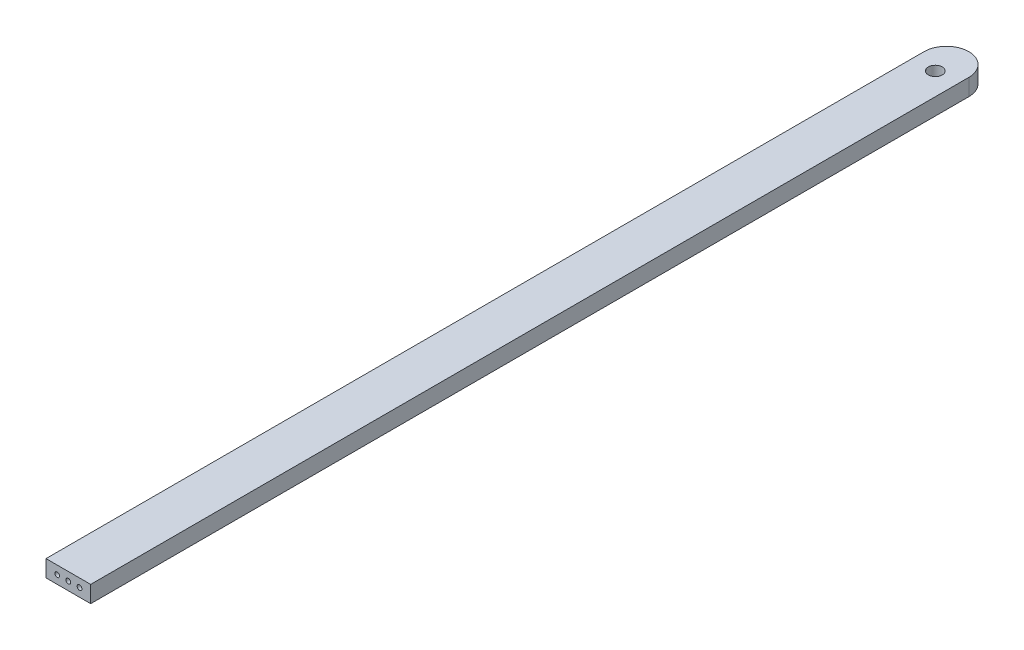
ISO-10303-21;
HEADER;
FILE_DESCRIPTION(('STEP AP214'),'2;1');
FILE_NAME('part.step','',(''),(''),'','','');
FILE_SCHEMA(('AUTOMOTIVE_DESIGN { 1 0 10303 214 1 1 1 1 }'));
ENDSEC;
DATA;
#1=APPLICATION_CONTEXT('core data for automotive mechanical design processes');
#2=APPLICATION_PROTOCOL_DEFINITION('international standard','automotive_design',2000,#1);
#3=PRODUCT_CONTEXT('',#1,'mechanical');
#4=PRODUCT('Part','Part','',(#3));
#5=PRODUCT_RELATED_PRODUCT_CATEGORY('part','',(#4));
#6=PRODUCT_DEFINITION_FORMATION('','',#4);
#7=PRODUCT_DEFINITION_CONTEXT('part definition',#1,'design');
#8=PRODUCT_DEFINITION('design','',#6,#7);
#9=PRODUCT_DEFINITION_SHAPE('','',#8);
#10=(LENGTH_UNIT() NAMED_UNIT(*) SI_UNIT(.MILLI.,.METRE.));
#11=(NAMED_UNIT(*) PLANE_ANGLE_UNIT() SI_UNIT($,.RADIAN.));
#12=(NAMED_UNIT(*) SI_UNIT($,.STERADIAN.) SOLID_ANGLE_UNIT());
#13=UNCERTAINTY_MEASURE_WITH_UNIT(LENGTH_MEASURE(1.E-05),#10,'distance_accuracy_value','');
#14=(GEOMETRIC_REPRESENTATION_CONTEXT(3) GLOBAL_UNCERTAINTY_ASSIGNED_CONTEXT((#13)) GLOBAL_UNIT_ASSIGNED_CONTEXT((#10,
#11,#12)) REPRESENTATION_CONTEXT('',''));
#15=CARTESIAN_POINT('',(0.,0.,0.));
#16=DIRECTION('',(0.,0.,1.));
#17=DIRECTION('',(1.,0.,0.));
#18=AXIS2_PLACEMENT_3D('',#15,#16,#17);
#19=CARTESIAN_POINT('',(0.,9.525,-6.35));
#20=DIRECTION('',(0.,-1.,0.));
#21=DIRECTION('',(0.,0.,-1.));
#22=AXIS2_PLACEMENT_3D('',#19,#20,#21);
#23=CYLINDRICAL_SURFACE('',#22,12.7);
#24=DIRECTION('',(0.,-1.,0.));
#25=VECTOR('',#24,1.);
#26=CARTESIAN_POINT('',(-12.7,9.525,-6.35));
#27=LINE('',#26,#25);
#28=CARTESIAN_POINT('',(-12.7,9.525,-6.35));
#29=VERTEX_POINT('',#28);
#30=CARTESIAN_POINT('',(-12.7,0.,-6.35));
#31=VERTEX_POINT('',#30);
#32=EDGE_CURVE('E185',#29,#31,#27,.T.);
#33=ORIENTED_EDGE('',*,*,#32,.F.);
#34=CARTESIAN_POINT('',(0.,9.525,-6.35));
#35=DIRECTION('',(0.,1.,0.));
#36=DIRECTION('',(0.,0.,1.));
#37=AXIS2_PLACEMENT_3D('',#34,#35,#36);
#38=CIRCLE('',#37,12.7);
#39=CARTESIAN_POINT('',(12.7,9.525,-6.35000000000007));
#40=VERTEX_POINT('',#39);
#41=EDGE_CURVE('E66',#40,#29,#38,.T.);
#42=ORIENTED_EDGE('',*,*,#41,.F.);
#43=DIRECTION('',(0.,-1.,0.));
#44=VECTOR('',#43,1.);
#45=CARTESIAN_POINT('',(12.7,9.525,-6.35));
#46=LINE('',#45,#44);
#47=CARTESIAN_POINT('',(12.7,0.,-6.35000000000007));
#48=VERTEX_POINT('',#47);
#49=EDGE_CURVE('E188',#48,#40,#46,.F.);
#50=ORIENTED_EDGE('',*,*,#49,.F.);
#51=CARTESIAN_POINT('',(0.,0.,-6.35));
#52=DIRECTION('',(0.,1.,0.));
#53=DIRECTION('',(0.,0.,1.));
#54=AXIS2_PLACEMENT_3D('',#51,#52,#53);
#55=CIRCLE('',#54,12.7);
#56=EDGE_CURVE('E11',#31,#48,#55,.F.);
#57=ORIENTED_EDGE('',*,*,#56,.F.);
#58=EDGE_LOOP('',(#33,#42,#50,#57));
#59=FACE_BOUND('',#58,.T.);
#60=ADVANCED_FACE('F57',(#59),#23,.T.);
#61=CARTESIAN_POINT('',(0.,9.525,0.));
#62=DIRECTION('',(0.,1.,0.));
#63=DIRECTION('',(0.,0.,1.));
#64=AXIS2_PLACEMENT_3D('',#61,#62,#63);
#65=PLANE('',#64);
#66=DIRECTION('',(0.,0.,-1.));
#67=VECTOR('',#66,1.);
#68=CARTESIAN_POINT('',(12.7,9.525,-19.05));
#69=LINE('',#68,#67);
#70=CARTESIAN_POINT('',(12.6999999999999,9.525,492.9124));
#71=VERTEX_POINT('',#70);
#72=EDGE_CURVE('E165',#71,#40,#69,.T.);
#73=ORIENTED_EDGE('',*,*,#72,.T.);
#74=ORIENTED_EDGE('',*,*,#41,.T.);
#75=DIRECTION('',(0.,0.,1.));
#76=VECTOR('',#75,1.);
#77=CARTESIAN_POINT('',(-12.7,9.525,-19.05));
#78=LINE('',#77,#76);
#79=CARTESIAN_POINT('',(-12.6999999999999,9.525,492.9124));
#80=VERTEX_POINT('',#79);
#81=EDGE_CURVE('E158',#29,#80,#78,.T.);
#82=ORIENTED_EDGE('',*,*,#81,.T.);
#83=DIRECTION('',(1.,0.,0.));
#84=VECTOR('',#83,1.);
#85=CARTESIAN_POINT('',(-12.6999999999999,9.525,492.9124));
#86=LINE('',#85,#84);
#87=EDGE_CURVE('E161',#80,#71,#86,.T.);
#88=ORIENTED_EDGE('',*,*,#87,.T.);
#89=EDGE_LOOP('',(#73,#74,#82,#88));
#90=FACE_BOUND('',#89,.T.);
#91=CARTESIAN_POINT('',(0.,9.525,0.));
#92=DIRECTION('',(0.,1.,0.));
#93=DIRECTION('',(0.,0.,1.));
#94=AXIS2_PLACEMENT_3D('',#91,#92,#93);
#95=CIRCLE('',#94,3.96875);
#96=CARTESIAN_POINT('',(0.,9.525,-3.96875));
#97=VERTEX_POINT('',#96);
#98=EDGE_CURVE('E150',#97,#97,#95,.T.);
#99=ORIENTED_EDGE('',*,*,#98,.F.);
#100=EDGE_LOOP('',(#99));
#101=FACE_BOUND('',#100,.T.);
#102=ADVANCED_FACE('F192',(#90,#101),#65,.T.);
#103=CARTESIAN_POINT('',(0.,0.,0.));
#104=DIRECTION('',(0.,1.,0.));
#105=DIRECTION('',(0.,0.,1.));
#106=AXIS2_PLACEMENT_3D('',#103,#104,#105);
#107=PLANE('',#106);
#108=DIRECTION('',(0.,0.,1.));
#109=VECTOR('',#108,1.);
#110=CARTESIAN_POINT('',(-12.7,0.,-19.05));
#111=LINE('',#110,#109);
#112=CARTESIAN_POINT('',(-12.6999999999999,0.,492.9124));
#113=VERTEX_POINT('',#112);
#114=EDGE_CURVE('E154',#31,#113,#111,.T.);
#115=ORIENTED_EDGE('',*,*,#114,.F.);
#116=ORIENTED_EDGE('',*,*,#56,.T.);
#117=DIRECTION('',(0.,0.,-1.));
#118=VECTOR('',#117,1.);
#119=CARTESIAN_POINT('',(12.7,0.,-19.05));
#120=LINE('',#119,#118);
#121=CARTESIAN_POINT('',(12.6999999999999,0.,492.9124));
#122=VERTEX_POINT('',#121);
#123=EDGE_CURVE('E162',#122,#48,#120,.T.);
#124=ORIENTED_EDGE('',*,*,#123,.F.);
#125=DIRECTION('',(1.,0.,0.));
#126=VECTOR('',#125,1.);
#127=CARTESIAN_POINT('',(-12.6999999999999,0.,492.9124));
#128=LINE('',#127,#126);
#129=EDGE_CURVE('E172',#113,#122,#128,.T.);
#130=ORIENTED_EDGE('',*,*,#129,.F.);
#131=EDGE_LOOP('',(#115,#116,#124,#130));
#132=FACE_BOUND('',#131,.T.);
#133=CARTESIAN_POINT('',(0.,0.,0.));
#134=DIRECTION('',(0.,1.,0.));
#135=DIRECTION('',(0.,0.,1.));
#136=AXIS2_PLACEMENT_3D('',#133,#134,#135);
#137=CIRCLE('',#136,3.96875);
#138=CARTESIAN_POINT('',(0.,0.,-3.96875));
#139=VERTEX_POINT('',#138);
#140=EDGE_CURVE('E149',#139,#139,#137,.T.);
#141=ORIENTED_EDGE('',*,*,#140,.T.);
#142=EDGE_LOOP('',(#141));
#143=FACE_BOUND('',#142,.T.);
#144=ADVANCED_FACE('F206',(#132,#143),#107,.F.);
#145=CARTESIAN_POINT('',(-12.7,9.525,-19.05));
#146=DIRECTION('',(1.,0.,0.));
#147=DIRECTION('',(0.,0.,-1.));
#148=AXIS2_PLACEMENT_3D('',#145,#146,#147);
#149=PLANE('',#148);
#150=ORIENTED_EDGE('',*,*,#81,.F.);
#151=ORIENTED_EDGE('',*,*,#32,.T.);
#152=ORIENTED_EDGE('',*,*,#114,.T.);
#153=DIRECTION('',(0.,-1.,0.));
#154=VECTOR('',#153,1.);
#155=CARTESIAN_POINT('',(-12.6999999999999,9.525,492.9124));
#156=LINE('',#155,#154);
#157=EDGE_CURVE('E181',#80,#113,#156,.T.);
#158=ORIENTED_EDGE('',*,*,#157,.F.);
#159=EDGE_LOOP('',(#150,#151,#152,#158));
#160=FACE_BOUND('',#159,.T.);
#161=ADVANCED_FACE('F199',(#160),#149,.F.);
#162=CARTESIAN_POINT('',(-12.6999999999999,9.525,492.9124));
#163=DIRECTION('',(0.,0.,-1.));
#164=DIRECTION('',(-1.,0.,0.));
#165=AXIS2_PLACEMENT_3D('',#162,#163,#164);
#166=PLANE('',#165);
#167=CARTESIAN_POINT('',(-6.34999999999997,4.7625,492.9124));
#168=DIRECTION('',(0.,0.,1.));
#169=DIRECTION('',(1.,0.,0.));
#170=AXIS2_PLACEMENT_3D('',#167,#168,#169);
#171=CIRCLE('',#170,1.35254999999999);
#172=CARTESIAN_POINT('',(-4.99744999999998,4.7625,492.9124));
#173=VERTEX_POINT('',#172);
#174=EDGE_CURVE('E127',#173,#173,#171,.T.);
#175=ORIENTED_EDGE('',*,*,#174,.F.);
#176=EDGE_LOOP('',(#175));
#177=FACE_BOUND('',#176,.T.);
#178=CARTESIAN_POINT('',(0.,4.7625,492.9124));
#179=DIRECTION('',(0.,0.,1.));
#180=DIRECTION('',(1.,0.,0.));
#181=AXIS2_PLACEMENT_3D('',#178,#179,#180);
#182=CIRCLE('',#181,1.35254999999999);
#183=CARTESIAN_POINT('',(1.35254999999999,4.7625,492.9124));
#184=VERTEX_POINT('',#183);
#185=EDGE_CURVE('E126',#184,#184,#182,.T.);
#186=ORIENTED_EDGE('',*,*,#185,.F.);
#187=EDGE_LOOP('',(#186));
#188=FACE_BOUND('',#187,.T.);
#189=CARTESIAN_POINT('',(6.34999999999997,4.7625,492.9124));
#190=DIRECTION('',(0.,0.,1.));
#191=DIRECTION('',(1.,0.,0.));
#192=AXIS2_PLACEMENT_3D('',#189,#190,#191);
#193=CIRCLE('',#192,1.35254999999999);
#194=CARTESIAN_POINT('',(7.70254999999996,4.7625,492.9124));
#195=VERTEX_POINT('',#194);
#196=EDGE_CURVE('E141',#195,#195,#193,.T.);
#197=ORIENTED_EDGE('',*,*,#196,.F.);
#198=EDGE_LOOP('',(#197));
#199=FACE_BOUND('',#198,.T.);
#200=ORIENTED_EDGE('',*,*,#129,.T.);
#201=DIRECTION('',(0.,-1.,0.));
#202=VECTOR('',#201,1.);
#203=CARTESIAN_POINT('',(12.6999999999999,9.525,492.9124));
#204=LINE('',#203,#202);
#205=EDGE_CURVE('E169',#71,#122,#204,.T.);
#206=ORIENTED_EDGE('',*,*,#205,.F.);
#207=ORIENTED_EDGE('',*,*,#87,.F.);
#208=ORIENTED_EDGE('',*,*,#157,.T.);
#209=EDGE_LOOP('',(#200,#206,#207,#208));
#210=FACE_BOUND('',#209,.T.);
#211=ADVANCED_FACE('F202',(#177,#188,#199,#210),#166,.F.);
#212=CARTESIAN_POINT('',(12.7,9.525,-19.05));
#213=DIRECTION('',(-1.,0.,0.));
#214=DIRECTION('',(0.,0.,1.));
#215=AXIS2_PLACEMENT_3D('',#212,#213,#214);
#216=PLANE('',#215);
#217=ORIENTED_EDGE('',*,*,#123,.T.);
#218=ORIENTED_EDGE('',*,*,#49,.T.);
#219=ORIENTED_EDGE('',*,*,#72,.F.);
#220=ORIENTED_EDGE('',*,*,#205,.T.);
#221=EDGE_LOOP('',(#217,#218,#219,#220));
#222=FACE_BOUND('',#221,.T.);
#223=ADVANCED_FACE('F205',(#222),#216,.F.);
#224=CARTESIAN_POINT('',(0.,9.525,0.));
#225=DIRECTION('',(0.,-1.,0.));
#226=DIRECTION('',(0.,0.,-1.));
#227=AXIS2_PLACEMENT_3D('',#224,#225,#226);
#228=CYLINDRICAL_SURFACE('',#227,3.96875);
#229=CARTESIAN_POINT('',(0.,9.525,-3.96875));
#230=CARTESIAN_POINT('',(0.,9.42578125,-3.96875));
#231=CARTESIAN_POINT('',(0.,9.3265625,-3.96875));
#232=CARTESIAN_POINT('',(0.,9.128125,-3.96875));
#233=CARTESIAN_POINT('',(0.,9.02890625,-3.96875));
#234=CARTESIAN_POINT('',(0.,8.83046875,-3.96875));
#235=CARTESIAN_POINT('',(0.,8.73125,-3.96875));
#236=CARTESIAN_POINT('',(0.,8.5328125,-3.96875));
#237=CARTESIAN_POINT('',(0.,8.43359375,-3.96875));
#238=CARTESIAN_POINT('',(0.,8.23515625,-3.96875));
#239=CARTESIAN_POINT('',(0.,8.1359375,-3.96875));
#240=CARTESIAN_POINT('',(0.,7.9375,-3.96875));
#241=CARTESIAN_POINT('',(0.,7.83828125,-3.96875));
#242=CARTESIAN_POINT('',(0.,7.63984375,-3.96875));
#243=CARTESIAN_POINT('',(0.,7.540625,-3.96875));
#244=CARTESIAN_POINT('',(0.,7.3421875,-3.96875));
#245=CARTESIAN_POINT('',(0.,7.24296875,-3.96875));
#246=CARTESIAN_POINT('',(0.,7.04453125,-3.96875));
#247=CARTESIAN_POINT('',(0.,6.9453125,-3.96875));
#248=CARTESIAN_POINT('',(0.,6.746875,-3.96875));
#249=CARTESIAN_POINT('',(0.,6.64765625,-3.96875));
#250=CARTESIAN_POINT('',(0.,6.44921875,-3.96875));
#251=CARTESIAN_POINT('',(0.,6.35,-3.96875));
#252=CARTESIAN_POINT('',(0.,6.1515625,-3.96875));
#253=CARTESIAN_POINT('',(0.,6.05234375,-3.96875));
#254=CARTESIAN_POINT('',(0.,5.85390625,-3.96875));
#255=CARTESIAN_POINT('',(0.,5.7546875,-3.96875));
#256=CARTESIAN_POINT('',(0.,5.55625,-3.96875));
#257=CARTESIAN_POINT('',(0.,5.45703125,-3.96875));
#258=CARTESIAN_POINT('',(0.,5.25859375,-3.96875));
#259=CARTESIAN_POINT('',(0.,5.159375,-3.96875));
#260=CARTESIAN_POINT('',(0.,4.9609375,-3.96875));
#261=CARTESIAN_POINT('',(0.,4.86171875,-3.96875));
#262=CARTESIAN_POINT('',(0.,4.66328125,-3.96875));
#263=CARTESIAN_POINT('',(0.,4.5640625,-3.96875));
#264=CARTESIAN_POINT('',(0.,4.365625,-3.96875));
#265=CARTESIAN_POINT('',(0.,4.26640625,-3.96875));
#266=CARTESIAN_POINT('',(0.,4.06796875,-3.96875));
#267=CARTESIAN_POINT('',(0.,3.96875,-3.96875));
#268=CARTESIAN_POINT('',(0.,3.7703125,-3.96875));
#269=CARTESIAN_POINT('',(0.,3.67109375,-3.96875));
#270=CARTESIAN_POINT('',(0.,3.47265625,-3.96875));
#271=CARTESIAN_POINT('',(0.,3.3734375,-3.96875));
#272=CARTESIAN_POINT('',(0.,3.175,-3.96875));
#273=CARTESIAN_POINT('',(0.,3.07578125,-3.96875));
#274=CARTESIAN_POINT('',(0.,2.87734375,-3.96875));
#275=CARTESIAN_POINT('',(0.,2.778125,-3.96875));
#276=CARTESIAN_POINT('',(0.,2.5796875,-3.96875));
#277=CARTESIAN_POINT('',(0.,2.48046875,-3.96875));
#278=CARTESIAN_POINT('',(0.,2.28203125,-3.96875));
#279=CARTESIAN_POINT('',(0.,2.1828125,-3.96875));
#280=CARTESIAN_POINT('',(0.,1.984375,-3.96875));
#281=CARTESIAN_POINT('',(0.,1.88515625,-3.96875));
#282=CARTESIAN_POINT('',(0.,1.68671875,-3.96875));
#283=CARTESIAN_POINT('',(0.,1.5875,-3.96875));
#284=CARTESIAN_POINT('',(0.,1.3890625,-3.96875));
#285=CARTESIAN_POINT('',(0.,1.28984375,-3.96875));
#286=CARTESIAN_POINT('',(0.,1.09140625,-3.96875));
#287=CARTESIAN_POINT('',(0.,0.992187500000001,-3.96875));
#288=CARTESIAN_POINT('',(0.,0.793750000000001,-3.96875));
#289=CARTESIAN_POINT('',(0.,0.69453125,-3.96875));
#290=CARTESIAN_POINT('',(0.,0.49609375,-3.96875));
#291=CARTESIAN_POINT('',(0.,0.396875,-3.96875));
#292=CARTESIAN_POINT('',(0.,0.1984375,-3.96875));
#293=CARTESIAN_POINT('',(0.,0.0992187500000001,-3.96875));
#294=CARTESIAN_POINT('',(0.,0.,-3.96875));
#295=B_SPLINE_CURVE_WITH_KNOTS('',3,(#229,#230,#231,#232,#233,#234,#235,#236,#237,#238,#239,
#240,#241,#242,#243,#244,#245,#246,#247,#248,#249,#250,#251,#252,#253,#254,#255,#256,#257,#258,
#259,#260,#261,#262,#263,#264,#265,#266,#267,#268,#269,#270,#271,#272,#273,#274,#275,#276,#277,
#278,#279,#280,#281,#282,#283,#284,#285,#286,#287,#288,#289,#290,#291,#292,#293,#294),
.UNSPECIFIED.,.F.,.F.,(4,2,2,2,2,2,2,2,2,2,2,2,2,2,2,2,2,2,2,2,2,2,2,2,2,2,2,2,2,2,2,2,4),(0.,
0.297656249999998,0.595312499999999,0.892968749999999,1.190625,1.48828125,1.7859375,2.08359375,
2.38125,2.67890625,2.9765625,3.27421875,3.571875,3.86953125,4.1671875,4.46484375,4.7625,
5.06015625,5.3578125,5.65546875,5.953125,6.25078125,6.5484375,6.84609375,7.14375,7.44140625,
7.7390625,8.03671875,8.334375,8.63203125,8.9296875,9.22734375,9.525),.UNSPECIFIED.);
#296=EDGE_CURVE('BSEAM212',#97,#139,#295,.T.);
#297=ORIENTED_EDGE('',*,*,#98,.T.);
#298=ORIENTED_EDGE('',*,*,#140,.F.);
#299=ORIENTED_EDGE('',*,*,#296,.T.);
#300=ORIENTED_EDGE('',*,*,#296,.F.);
#301=EDGE_LOOP('',(#297,#299,#298,#300));
#302=FACE_BOUND('',#301,.T.);
#303=ADVANCED_FACE('F212',(#302),#228,.F.);
#304=CARTESIAN_POINT('',(6.34999999999997,4.7625,479.425));
#305=DIRECTION('',(0.,0.,1.));
#306=DIRECTION('',(1.,0.,0.));
#307=AXIS2_PLACEMENT_3D('',#304,#305,#306);
#308=CONICAL_SURFACE('',#307,1.35254999999999,1.02974425867664);
#309=CARTESIAN_POINT('',(6.34999999999997,4.7625,478.612305969734));
#310=VERTEX_POINT('',#309);
#311=VERTEX_LOOP('',#310);
#312=FACE_BOUND('',#311,.T.);
#313=CARTESIAN_POINT('',(6.34999999999997,4.7625,479.425));
#314=DIRECTION('',(0.,0.,1.));
#315=DIRECTION('',(1.,0.,0.));
#316=AXIS2_PLACEMENT_3D('',#313,#314,#315);
#317=CIRCLE('',#316,1.35254999999999);
#318=CARTESIAN_POINT('',(7.70254999999996,4.7625,479.425));
#319=VERTEX_POINT('',#318);
#320=EDGE_CURVE('E145',#319,#319,#317,.T.);
#321=ORIENTED_EDGE('',*,*,#320,.T.);
#322=EDGE_LOOP('',(#321));
#323=FACE_BOUND('',#322,.T.);
#324=ADVANCED_FACE('F214',(#312,#323),#308,.F.);
#325=CARTESIAN_POINT('',(6.34999999999997,4.7625,492.9124));
#326=DIRECTION('',(0.,0.,1.));
#327=DIRECTION('',(1.,0.,0.));
#328=AXIS2_PLACEMENT_3D('',#325,#326,#327);
#329=CYLINDRICAL_SURFACE('',#328,1.35254999999999);
#330=ORIENTED_EDGE('',*,*,#320,.F.);
#331=EDGE_LOOP('',(#330));
#332=FACE_BOUND('',#331,.T.);
#333=ORIENTED_EDGE('',*,*,#196,.T.);
#334=EDGE_LOOP('',(#333));
#335=FACE_BOUND('',#334,.T.);
#336=ADVANCED_FACE('F220',(#332,#335),#329,.F.);
#337=CARTESIAN_POINT('',(0.,4.7625,479.425));
#338=DIRECTION('',(0.,0.,1.));
#339=DIRECTION('',(1.,0.,0.));
#340=AXIS2_PLACEMENT_3D('',#337,#338,#339);
#341=CONICAL_SURFACE('',#340,1.35254999999999,1.02974425867664);
#342=CARTESIAN_POINT('',(0.,4.7625,478.612305969734));
#343=VERTEX_POINT('',#342);
#344=VERTEX_LOOP('',#343);
#345=FACE_BOUND('',#344,.T.);
#346=CARTESIAN_POINT('',(0.,4.7625,479.425));
#347=DIRECTION('',(0.,0.,1.));
#348=DIRECTION('',(1.,0.,0.));
#349=AXIS2_PLACEMENT_3D('',#346,#347,#348);
#350=CIRCLE('',#349,1.35254999999999);
#351=CARTESIAN_POINT('',(1.35254999999999,4.7625,479.425));
#352=VERTEX_POINT('',#351);
#353=EDGE_CURVE('E133',#352,#352,#350,.T.);
#354=ORIENTED_EDGE('',*,*,#353,.T.);
#355=EDGE_LOOP('',(#354));
#356=FACE_BOUND('',#355,.T.);
#357=ADVANCED_FACE('F256',(#345,#356),#341,.F.);
#358=CARTESIAN_POINT('',(0.,4.7625,492.9124));
#359=DIRECTION('',(0.,0.,1.));
#360=DIRECTION('',(1.,0.,0.));
#361=AXIS2_PLACEMENT_3D('',#358,#359,#360);
#362=CYLINDRICAL_SURFACE('',#361,1.35254999999999);
#363=ORIENTED_EDGE('',*,*,#353,.F.);
#364=EDGE_LOOP('',(#363));
#365=FACE_BOUND('',#364,.T.);
#366=ORIENTED_EDGE('',*,*,#185,.T.);
#367=EDGE_LOOP('',(#366));
#368=FACE_BOUND('',#367,.T.);
#369=ADVANCED_FACE('F119',(#365,#368),#362,.F.);
#370=CARTESIAN_POINT('',(-6.34999999999997,4.7625,479.425));
#371=DIRECTION('',(0.,0.,1.));
#372=DIRECTION('',(1.,0.,0.));
#373=AXIS2_PLACEMENT_3D('',#370,#371,#372);
#374=CONICAL_SURFACE('',#373,1.35254999999999,1.02974425867664);
#375=CARTESIAN_POINT('',(-6.34999999999998,4.7625,478.612305969734));
#376=VERTEX_POINT('',#375);
#377=VERTEX_LOOP('',#376);
#378=FACE_BOUND('',#377,.T.);
#379=CARTESIAN_POINT('',(-6.34999999999997,4.7625,479.425));
#380=DIRECTION('',(0.,0.,1.));
#381=DIRECTION('',(1.,0.,0.));
#382=AXIS2_PLACEMENT_3D('',#379,#380,#381);
#383=CIRCLE('',#382,1.35254999999999);
#384=CARTESIAN_POINT('',(-4.99744999999998,4.7625,479.425));
#385=VERTEX_POINT('',#384);
#386=EDGE_CURVE('E123',#385,#385,#383,.T.);
#387=ORIENTED_EDGE('',*,*,#386,.T.);
#388=EDGE_LOOP('',(#387));
#389=FACE_BOUND('',#388,.T.);
#390=ADVANCED_FACE('F115',(#378,#389),#374,.F.);
#391=CARTESIAN_POINT('',(-6.34999999999997,4.7625,492.9124));
#392=DIRECTION('',(0.,0.,1.));
#393=DIRECTION('',(1.,0.,0.));
#394=AXIS2_PLACEMENT_3D('',#391,#392,#393);
#395=CYLINDRICAL_SURFACE('',#394,1.35254999999999);
#396=ORIENTED_EDGE('',*,*,#386,.F.);
#397=EDGE_LOOP('',(#396));
#398=FACE_BOUND('',#397,.T.);
#399=ORIENTED_EDGE('',*,*,#174,.T.);
#400=EDGE_LOOP('',(#399));
#401=FACE_BOUND('',#400,.T.);
#402=ADVANCED_FACE('F118',(#398,#401),#395,.F.);
#403=CLOSED_SHELL('',(#60,#102,#144,#161,#211,#223,#303,#324,#336,#357,#369,#390,#402));
#404=MANIFOLD_SOLID_BREP('B2',#403);
#405=ADVANCED_BREP_SHAPE_REPRESENTATION('',(#18,#404),#14);
#406=SHAPE_DEFINITION_REPRESENTATION(#9,#405);
ENDSEC;
END-ISO-10303-21;
